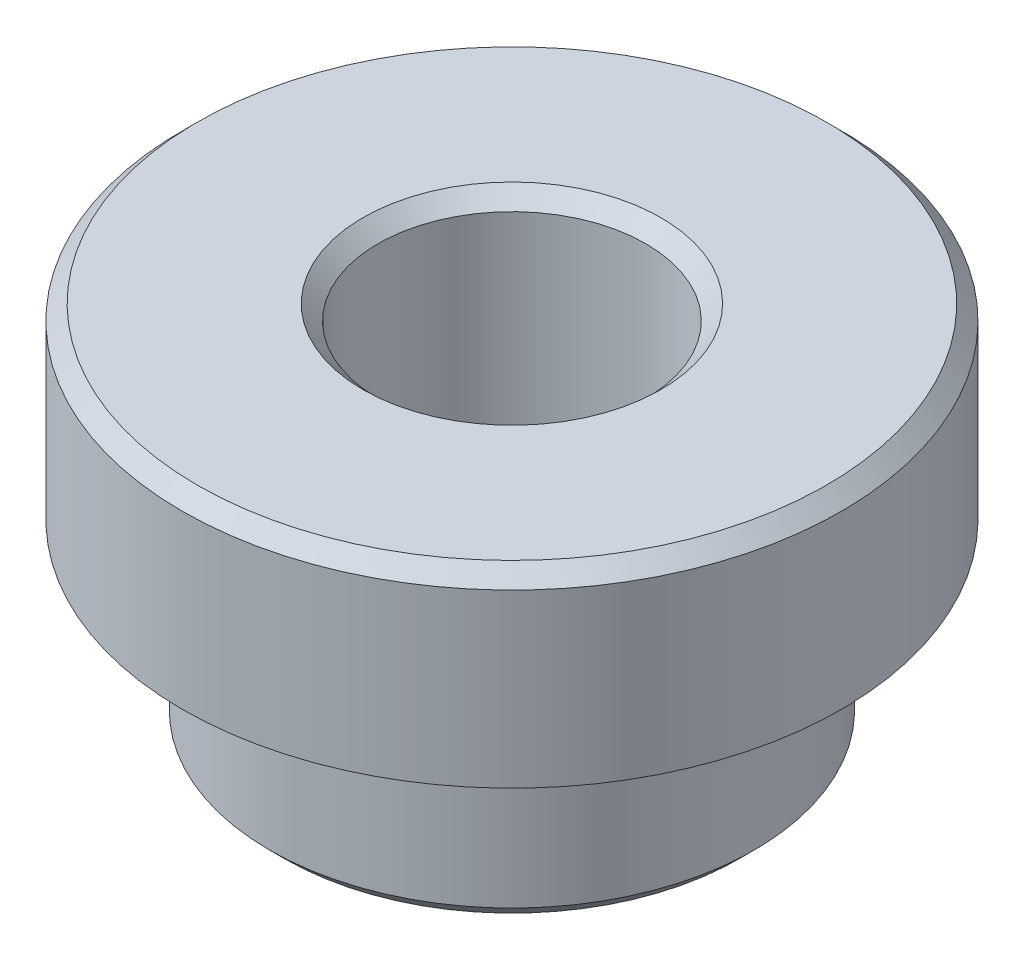
ISO-10303-21;
HEADER;
FILE_DESCRIPTION(('STEP AP214'),'2;1');
FILE_NAME('part.step','',(''),(''),'','','');
FILE_SCHEMA(('AUTOMOTIVE_DESIGN { 1 0 10303 214 1 1 1 1 }'));
ENDSEC;
DATA;
#1=APPLICATION_CONTEXT('core data for automotive mechanical design processes');
#2=APPLICATION_PROTOCOL_DEFINITION('international standard','automotive_design',2000,#1);
#3=PRODUCT_CONTEXT('',#1,'mechanical');
#4=PRODUCT('Part','Part','',(#3));
#5=PRODUCT_RELATED_PRODUCT_CATEGORY('part','',(#4));
#6=PRODUCT_DEFINITION_FORMATION('','',#4);
#7=PRODUCT_DEFINITION_CONTEXT('part definition',#1,'design');
#8=PRODUCT_DEFINITION('design','',#6,#7);
#9=PRODUCT_DEFINITION_SHAPE('','',#8);
#10=(LENGTH_UNIT() NAMED_UNIT(*) SI_UNIT(.MILLI.,.METRE.));
#11=(NAMED_UNIT(*) PLANE_ANGLE_UNIT() SI_UNIT($,.RADIAN.));
#12=(NAMED_UNIT(*) SI_UNIT($,.STERADIAN.) SOLID_ANGLE_UNIT());
#13=UNCERTAINTY_MEASURE_WITH_UNIT(LENGTH_MEASURE(1.E-05),#10,'distance_accuracy_value','');
#14=(GEOMETRIC_REPRESENTATION_CONTEXT(3) GLOBAL_UNCERTAINTY_ASSIGNED_CONTEXT((#13)) GLOBAL_UNIT_ASSIGNED_CONTEXT((#10,
#11,#12)) REPRESENTATION_CONTEXT('',''));
#15=CARTESIAN_POINT('',(0.,0.,0.));
#16=DIRECTION('',(0.,0.,1.));
#17=DIRECTION('',(1.,0.,0.));
#18=AXIS2_PLACEMENT_3D('',#15,#16,#17);
#19=CARTESIAN_POINT('',(0.,1.524,0.));
#20=DIRECTION('',(0.,-1.,0.));
#21=DIRECTION('',(0.,0.,-1.));
#22=AXIS2_PLACEMENT_3D('',#19,#20,#21);
#23=CYLINDRICAL_SURFACE('',#22,2.0447);
#24=CARTESIAN_POINT('',(0.,0.127000000000003,0.));
#25=DIRECTION('',(0.,1.,0.));
#26=DIRECTION('',(0.,0.,1.));
#27=AXIS2_PLACEMENT_3D('',#24,#25,#26);
#28=CIRCLE('',#27,2.0447);
#29=CARTESIAN_POINT('',(0.,0.127000000000003,2.0447));
#30=VERTEX_POINT('',#29);
#31=EDGE_CURVE('E61',#30,#30,#28,.T.);
#32=ORIENTED_EDGE('',*,*,#31,.T.);
#33=EDGE_LOOP('',(#32));
#34=FACE_BOUND('',#33,.T.);
#35=CARTESIAN_POINT('',(0.,1.524,0.));
#36=DIRECTION('',(0.,1.,0.));
#37=DIRECTION('',(0.,0.,1.));
#38=AXIS2_PLACEMENT_3D('',#35,#36,#37);
#39=CIRCLE('',#38,2.0447);
#40=CARTESIAN_POINT('',(0.,1.524,2.0447));
#41=VERTEX_POINT('',#40);
#42=EDGE_CURVE('E64',#41,#41,#39,.T.);
#43=ORIENTED_EDGE('',*,*,#42,.F.);
#44=EDGE_LOOP('',(#43));
#45=FACE_BOUND('',#44,.T.);
#46=ADVANCED_FACE('F37',(#34,#45),#23,.T.);
#47=CARTESIAN_POINT('',(0.,0.,0.));
#48=DIRECTION('',(0.,1.,0.));
#49=DIRECTION('',(0.,0.,1.));
#50=AXIS2_PLACEMENT_3D('',#47,#48,#49);
#51=PLANE('',#50);
#52=CARTESIAN_POINT('',(0.,0.,0.));
#53=DIRECTION('',(0.,1.,0.));
#54=DIRECTION('',(0.,0.,1.));
#55=AXIS2_PLACEMENT_3D('',#52,#53,#54);
#56=CIRCLE('',#55,1.9177);
#57=CARTESIAN_POINT('',(0.,0.,1.9177));
#58=VERTEX_POINT('',#57);
#59=EDGE_CURVE('E58',#58,#58,#56,.F.);
#60=ORIENTED_EDGE('',*,*,#59,.T.);
#61=EDGE_LOOP('',(#60));
#62=FACE_BOUND('',#61,.T.);
#63=CARTESIAN_POINT('',(0.,0.,0.));
#64=DIRECTION('',(0.,1.,0.));
#65=DIRECTION('',(0.,0.,1.));
#66=AXIS2_PLACEMENT_3D('',#63,#64,#65);
#67=CIRCLE('',#66,1.1303);
#68=CARTESIAN_POINT('',(0.,0.,1.1303));
#69=VERTEX_POINT('',#68);
#70=EDGE_CURVE('E70',#69,#69,#67,.T.);
#71=ORIENTED_EDGE('',*,*,#70,.T.);
#72=EDGE_LOOP('',(#71));
#73=FACE_BOUND('',#72,.T.);
#74=ADVANCED_FACE('F74',(#62,#73),#51,.F.);
#75=CARTESIAN_POINT('',(0.,3.0988,0.));
#76=DIRECTION('',(0.,-1.,0.));
#77=DIRECTION('',(0.,0.,-1.));
#78=AXIS2_PLACEMENT_3D('',#75,#76,#77);
#79=CYLINDRICAL_SURFACE('',#78,2.7813);
#80=CARTESIAN_POINT('',(0.,2.9718,0.));
#81=DIRECTION('',(0.,1.,0.));
#82=DIRECTION('',(0.,0.,1.));
#83=AXIS2_PLACEMENT_3D('',#80,#81,#82);
#84=CIRCLE('',#83,2.7813);
#85=CARTESIAN_POINT('',(0.,2.9718,2.7813));
#86=VERTEX_POINT('',#85);
#87=EDGE_CURVE('E45',#86,#86,#84,.F.);
#88=ORIENTED_EDGE('',*,*,#87,.T.);
#89=EDGE_LOOP('',(#88));
#90=FACE_BOUND('',#89,.T.);
#91=CARTESIAN_POINT('',(0.,1.524,0.));
#92=DIRECTION('',(0.,1.,0.));
#93=DIRECTION('',(0.,0.,1.));
#94=AXIS2_PLACEMENT_3D('',#91,#92,#93);
#95=CIRCLE('',#94,2.7813);
#96=CARTESIAN_POINT('',(0.,1.524,2.7813));
#97=VERTEX_POINT('',#96);
#98=EDGE_CURVE('E67',#97,#97,#95,.T.);
#99=ORIENTED_EDGE('',*,*,#98,.T.);
#100=EDGE_LOOP('',(#99));
#101=FACE_BOUND('',#100,.T.);
#102=ADVANCED_FACE('F98',(#90,#101),#79,.T.);
#103=CARTESIAN_POINT('',(0.,3.0988,0.));
#104=DIRECTION('',(0.,1.,0.));
#105=DIRECTION('',(0.,0.,1.));
#106=AXIS2_PLACEMENT_3D('',#103,#104,#105);
#107=PLANE('',#106);
#108=CARTESIAN_POINT('',(0.,3.0988,0.));
#109=DIRECTION('',(0.,1.,0.));
#110=DIRECTION('',(0.,0.,1.));
#111=AXIS2_PLACEMENT_3D('',#108,#109,#110);
#112=CIRCLE('',#111,2.6543);
#113=CARTESIAN_POINT('',(0.,3.0988,2.6543));
#114=VERTEX_POINT('',#113);
#115=EDGE_CURVE('E49',#114,#114,#112,.T.);
#116=ORIENTED_EDGE('',*,*,#115,.T.);
#117=EDGE_LOOP('',(#116));
#118=FACE_BOUND('',#117,.T.);
#119=CARTESIAN_POINT('',(0.,3.0988,0.));
#120=DIRECTION('',(0.,1.,0.));
#121=DIRECTION('',(0.,0.,1.));
#122=AXIS2_PLACEMENT_3D('',#119,#120,#121);
#123=CIRCLE('',#122,1.25729999999999);
#124=CARTESIAN_POINT('',(0.,3.0988,1.25729999999999));
#125=VERTEX_POINT('',#124);
#126=EDGE_CURVE('E53',#125,#125,#123,.F.);
#127=ORIENTED_EDGE('',*,*,#126,.T.);
#128=EDGE_LOOP('',(#127));
#129=FACE_BOUND('',#128,.T.);
#130=ADVANCED_FACE('F88',(#118,#129),#107,.T.);
#131=CARTESIAN_POINT('',(0.,1.524,0.));
#132=DIRECTION('',(0.,1.,0.));
#133=DIRECTION('',(0.,0.,1.));
#134=AXIS2_PLACEMENT_3D('',#131,#132,#133);
#135=PLANE('',#134);
#136=ORIENTED_EDGE('',*,*,#42,.T.);
#137=EDGE_LOOP('',(#136));
#138=FACE_BOUND('',#137,.T.);
#139=ORIENTED_EDGE('',*,*,#98,.F.);
#140=EDGE_LOOP('',(#139));
#141=FACE_BOUND('',#140,.T.);
#142=ADVANCED_FACE('F79',(#138,#141),#135,.F.);
#143=CARTESIAN_POINT('',(0.,3.0988,0.));
#144=DIRECTION('',(0.,1.,0.));
#145=DIRECTION('',(0.,0.,1.));
#146=AXIS2_PLACEMENT_3D('',#143,#144,#145);
#147=CYLINDRICAL_SURFACE('',#146,1.13029999999999);
#148=CARTESIAN_POINT('',(0.,2.97180000000001,0.));
#149=DIRECTION('',(0.,1.,0.));
#150=DIRECTION('',(0.,0.,1.));
#151=AXIS2_PLACEMENT_3D('',#148,#149,#150);
#152=CIRCLE('',#151,1.13029999999999);
#153=CARTESIAN_POINT('',(0.,2.97180000000001,1.13029999999999));
#154=VERTEX_POINT('',#153);
#155=EDGE_CURVE('E10',#154,#154,#152,.T.);
#156=ORIENTED_EDGE('',*,*,#155,.T.);
#157=EDGE_LOOP('',(#156));
#158=FACE_BOUND('',#157,.T.);
#159=ORIENTED_EDGE('',*,*,#70,.F.);
#160=EDGE_LOOP('',(#159));
#161=FACE_BOUND('',#160,.T.);
#162=ADVANCED_FACE('F76',(#158,#161),#147,.F.);
#163=CARTESIAN_POINT('',(0.,0.127000000000003,0.));
#164=DIRECTION('',(0.,1.,0.));
#165=DIRECTION('',(0.,0.,1.));
#166=AXIS2_PLACEMENT_3D('',#163,#164,#165);
#167=CONICAL_SURFACE('',#166,2.0447,0.78539816339745);
#168=ORIENTED_EDGE('',*,*,#59,.F.);
#169=EDGE_LOOP('',(#168));
#170=FACE_BOUND('',#169,.T.);
#171=ORIENTED_EDGE('',*,*,#31,.F.);
#172=EDGE_LOOP('',(#171));
#173=FACE_BOUND('',#172,.T.);
#174=ADVANCED_FACE('F78',(#170,#173),#167,.T.);
#175=CARTESIAN_POINT('',(0.,3.0988,0.));
#176=DIRECTION('',(0.,-1.,0.));
#177=DIRECTION('',(0.,0.,-1.));
#178=AXIS2_PLACEMENT_3D('',#175,#176,#177);
#179=CONICAL_SURFACE('',#178,2.6543,0.785398163397448);
#180=ORIENTED_EDGE('',*,*,#87,.F.);
#181=EDGE_LOOP('',(#180));
#182=FACE_BOUND('',#181,.T.);
#183=ORIENTED_EDGE('',*,*,#115,.F.);
#184=EDGE_LOOP('',(#183));
#185=FACE_BOUND('',#184,.T.);
#186=ADVANCED_FACE('F85',(#182,#185),#179,.T.);
#187=CARTESIAN_POINT('',(0.,2.97180000000001,0.));
#188=DIRECTION('',(0.,1.,0.));
#189=DIRECTION('',(0.,0.,1.));
#190=AXIS2_PLACEMENT_3D('',#187,#188,#189);
#191=CONICAL_SURFACE('',#190,1.13029999999999,0.78539816339745);
#192=ORIENTED_EDGE('',*,*,#126,.F.);
#193=EDGE_LOOP('',(#192));
#194=FACE_BOUND('',#193,.T.);
#195=ORIENTED_EDGE('',*,*,#155,.F.);
#196=EDGE_LOOP('',(#195));
#197=FACE_BOUND('',#196,.T.);
#198=ADVANCED_FACE('F40',(#194,#197),#191,.F.);
#199=CLOSED_SHELL('',(#46,#74,#102,#130,#142,#162,#174,#186,#198));
#200=MANIFOLD_SOLID_BREP('B2',#199);
#201=ADVANCED_BREP_SHAPE_REPRESENTATION('',(#18,#200),#14);
#202=SHAPE_DEFINITION_REPRESENTATION(#9,#201);
ENDSEC;
END-ISO-10303-21;
